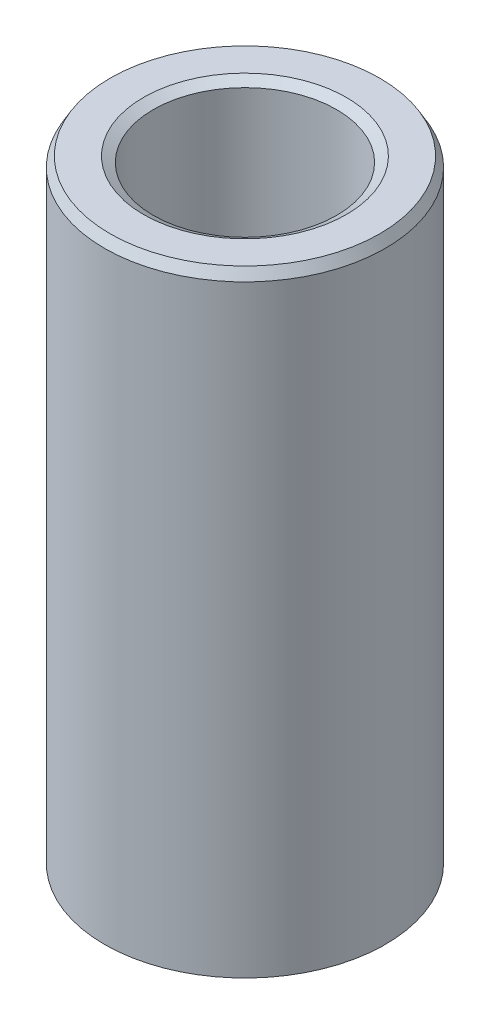
ISO-10303-21;
HEADER;
FILE_DESCRIPTION(('STEP AP214'),'2;1');
FILE_NAME('part.step','',(''),(''),'','','');
FILE_SCHEMA(('AUTOMOTIVE_DESIGN { 1 0 10303 214 1 1 1 1 }'));
ENDSEC;
DATA;
#1=APPLICATION_CONTEXT('core data for automotive mechanical design processes');
#2=APPLICATION_PROTOCOL_DEFINITION('international standard','automotive_design',2000,#1);
#3=PRODUCT_CONTEXT('',#1,'mechanical');
#4=PRODUCT('Part','Part','',(#3));
#5=PRODUCT_RELATED_PRODUCT_CATEGORY('part','',(#4));
#6=PRODUCT_DEFINITION_FORMATION('','',#4);
#7=PRODUCT_DEFINITION_CONTEXT('part definition',#1,'design');
#8=PRODUCT_DEFINITION('design','',#6,#7);
#9=PRODUCT_DEFINITION_SHAPE('','',#8);
#10=(LENGTH_UNIT() NAMED_UNIT(*) SI_UNIT(.MILLI.,.METRE.));
#11=(NAMED_UNIT(*) PLANE_ANGLE_UNIT() SI_UNIT($,.RADIAN.));
#12=(NAMED_UNIT(*) SI_UNIT($,.STERADIAN.) SOLID_ANGLE_UNIT());
#13=UNCERTAINTY_MEASURE_WITH_UNIT(LENGTH_MEASURE(1.E-05),#10,'distance_accuracy_value','');
#14=(GEOMETRIC_REPRESENTATION_CONTEXT(3) GLOBAL_UNCERTAINTY_ASSIGNED_CONTEXT((#13)) GLOBAL_UNIT_ASSIGNED_CONTEXT((#10,
#11,#12)) REPRESENTATION_CONTEXT('',''));
#15=CARTESIAN_POINT('',(0.,0.,0.));
#16=DIRECTION('',(0.,0.,1.));
#17=DIRECTION('',(1.,0.,0.));
#18=AXIS2_PLACEMENT_3D('',#15,#16,#17);
#19=CARTESIAN_POINT('',(0.,121.049952871459,0.));
#20=DIRECTION('',(0.,-1.,0.));
#21=DIRECTION('',(0.,0.,-1.));
#22=AXIS2_PLACEMENT_3D('',#19,#20,#21);
#23=CYLINDRICAL_SURFACE('',#22,27.5);
#24=CARTESIAN_POINT('',(0.,1.10536951392151,0.));
#25=DIRECTION('',(0.,1.,0.));
#26=DIRECTION('',(0.,0.,1.));
#27=AXIS2_PLACEMENT_3D('',#24,#25,#26);
#28=CIRCLE('',#27,27.5);
#29=CARTESIAN_POINT('',(0.,1.10536951392151,27.5));
#30=VERTEX_POINT('',#29);
#31=EDGE_CURVE('E10',#30,#30,#28,.T.);
#32=ORIENTED_EDGE('',*,*,#31,.T.);
#33=EDGE_LOOP('',(#32));
#34=FACE_BOUND('',#33,.T.);
#35=CARTESIAN_POINT('',(0.,119.13539671221,0.));
#36=DIRECTION('',(0.,1.,0.));
#37=DIRECTION('',(0.,0.,1.));
#38=AXIS2_PLACEMENT_3D('',#35,#36,#37);
#39=CIRCLE('',#38,27.5);
#40=CARTESIAN_POINT('',(0.,119.13539671221,27.5));
#41=VERTEX_POINT('',#40);
#42=EDGE_CURVE('E50',#41,#41,#39,.F.);
#43=ORIENTED_EDGE('',*,*,#42,.T.);
#44=EDGE_LOOP('',(#43));
#45=FACE_BOUND('',#44,.T.);
#46=ADVANCED_FACE('F39',(#34,#45),#23,.T.);
#47=CARTESIAN_POINT('',(0.,121.049952871459,0.));
#48=DIRECTION('',(0.,1.,0.));
#49=DIRECTION('',(0.,0.,1.));
#50=AXIS2_PLACEMENT_3D('',#47,#48,#49);
#51=PLANE('',#50);
#52=CARTESIAN_POINT('',(0.,121.049952871459,0.));
#53=DIRECTION('',(0.,1.,0.));
#54=DIRECTION('',(0.,0.,1.));
#55=AXIS2_PLACEMENT_3D('',#52,#53,#54);
#56=CIRCLE('',#55,19.8651325305748);
#57=CARTESIAN_POINT('',(0.,121.049952871459,19.8651325305748));
#58=VERTEX_POINT('',#57);
#59=EDGE_CURVE('E58',#58,#58,#56,.F.);
#60=ORIENTED_EDGE('',*,*,#59,.T.);
#61=EDGE_LOOP('',(#60));
#62=FACE_BOUND('',#61,.T.);
#63=CARTESIAN_POINT('',(0.,121.049952871459,0.));
#64=DIRECTION('',(0.,1.,0.));
#65=DIRECTION('',(0.,0.,1.));
#66=AXIS2_PLACEMENT_3D('',#63,#64,#65);
#67=CIRCLE('',#66,26.3946304860785);
#68=CARTESIAN_POINT('',(0.,121.049952871459,26.3946304860785));
#69=VERTEX_POINT('',#68);
#70=EDGE_CURVE('E61',#69,#69,#67,.T.);
#71=ORIENTED_EDGE('',*,*,#70,.T.);
#72=EDGE_LOOP('',(#71));
#73=FACE_BOUND('',#72,.T.);
#74=ADVANCED_FACE('F88',(#62,#73),#51,.T.);
#75=CARTESIAN_POINT('',(0.,0.,0.));
#76=DIRECTION('',(0.,1.,0.));
#77=DIRECTION('',(0.,0.,1.));
#78=AXIS2_PLACEMENT_3D('',#75,#76,#77);
#79=PLANE('',#78);
#80=CARTESIAN_POINT('',(0.,0.,0.));
#81=DIRECTION('',(0.,1.,0.));
#82=DIRECTION('',(0.,0.,1.));
#83=AXIS2_PLACEMENT_3D('',#80,#81,#82);
#84=CIRCLE('',#83,19.0559458852465);
#85=CARTESIAN_POINT('',(0.,0.,-19.0559458852465));
#86=VERTEX_POINT('',#85);
#87=EDGE_CURVE('E51',#86,#86,#84,.T.);
#88=ORIENTED_EDGE('',*,*,#87,.T.);
#89=EDGE_LOOP('',(#88));
#90=FACE_BOUND('',#89,.T.);
#91=CARTESIAN_POINT('',(0.,0.,0.));
#92=DIRECTION('',(0.,1.,0.));
#93=DIRECTION('',(0.,0.,1.));
#94=AXIS2_PLACEMENT_3D('',#91,#92,#93);
#95=CIRCLE('',#94,25.5854438407502);
#96=CARTESIAN_POINT('',(0.,0.,25.5854438407502));
#97=VERTEX_POINT('',#96);
#98=EDGE_CURVE('E54',#97,#97,#95,.F.);
#99=ORIENTED_EDGE('',*,*,#98,.T.);
#100=EDGE_LOOP('',(#99));
#101=FACE_BOUND('',#100,.T.);
#102=ADVANCED_FACE('F83',(#90,#101),#79,.F.);
#103=CARTESIAN_POINT('',(0.,121.049952871459,0.));
#104=DIRECTION('',(0.,-1.,0.));
#105=DIRECTION('',(0.,0.,-1.));
#106=AXIS2_PLACEMENT_3D('',#103,#104,#105);
#107=CYLINDRICAL_SURFACE('',#106,17.950576371325);
#108=CARTESIAN_POINT('',(0.,119.944583357538,0.));
#109=DIRECTION('',(0.,1.,0.));
#110=DIRECTION('',(0.,0.,1.));
#111=AXIS2_PLACEMENT_3D('',#108,#109,#110);
#112=CIRCLE('',#111,17.950576371325);
#113=CARTESIAN_POINT('',(0.,119.944583357538,17.950576371325));
#114=VERTEX_POINT('',#113);
#115=EDGE_CURVE('E67',#114,#114,#112,.T.);
#116=ORIENTED_EDGE('',*,*,#115,.T.);
#117=EDGE_LOOP('',(#116));
#118=FACE_BOUND('',#117,.T.);
#119=CARTESIAN_POINT('',(0.,1.91455615924981,0.));
#120=DIRECTION('',(0.,1.,0.));
#121=DIRECTION('',(0.,0.,1.));
#122=AXIS2_PLACEMENT_3D('',#119,#120,#121);
#123=CIRCLE('',#122,17.950576371325);
#124=CARTESIAN_POINT('',(0.,1.91455615924981,-17.950576371325));
#125=VERTEX_POINT('',#124);
#126=EDGE_CURVE('E69',#125,#125,#123,.F.);
#127=ORIENTED_EDGE('',*,*,#126,.T.);
#128=EDGE_LOOP('',(#127));
#129=FACE_BOUND('',#128,.T.);
#130=ADVANCED_FACE('F71',(#118,#129),#107,.F.);
#131=CARTESIAN_POINT('',(0.,119.944583357538,0.));
#132=DIRECTION('',(0.,1.,0.));
#133=DIRECTION('',(0.,0.,1.));
#134=AXIS2_PLACEMENT_3D('',#131,#132,#133);
#135=CONICAL_SURFACE('',#134,17.950576371325,1.0471975511966);
#136=ORIENTED_EDGE('',*,*,#59,.F.);
#137=EDGE_LOOP('',(#136));
#138=FACE_BOUND('',#137,.T.);
#139=ORIENTED_EDGE('',*,*,#115,.F.);
#140=EDGE_LOOP('',(#139));
#141=FACE_BOUND('',#140,.T.);
#142=ADVANCED_FACE('F77',(#138,#141),#135,.F.);
#143=CARTESIAN_POINT('',(0.,0.,0.));
#144=DIRECTION('',(0.,-1.,0.));
#145=DIRECTION('',(0.,0.,-1.));
#146=AXIS2_PLACEMENT_3D('',#143,#144,#145);
#147=CONICAL_SURFACE('',#146,19.0559458852465,0.523598775598295);
#148=CARTESIAN_POINT('',(0.,1.91455615924981,-17.950576371325));
#149=CARTESIAN_POINT('',(0.,1.89461286592429,-17.962090637095));
#150=CARTESIAN_POINT('',(0.,1.87466957259877,-17.973604902865));
#151=CARTESIAN_POINT('',(0.,1.83478298594773,-17.996633434405));
#152=CARTESIAN_POINT('',(0.,1.81483969262221,-18.008147700175));
#153=CARTESIAN_POINT('',(0.,1.77495310597117,-18.0311762317151));
#154=CARTESIAN_POINT('',(0.,1.75500981264566,-18.0426904974851));
#155=CARTESIAN_POINT('',(0.,1.71512322599462,-18.0657190290251));
#156=CARTESIAN_POINT('',(0.,1.6951799326691,-18.0772332947951));
#157=CARTESIAN_POINT('',(0.,1.65529334601806,-18.1002618263352));
#158=CARTESIAN_POINT('',(0.,1.63535005269254,-18.1117760921052));
#159=CARTESIAN_POINT('',(0.,1.5954634660415,-18.1348046236452));
#160=CARTESIAN_POINT('',(0.,1.57552017271599,-18.1463188894152));
#161=CARTESIAN_POINT('',(0.,1.53563358606495,-18.1693474209553));
#162=CARTESIAN_POINT('',(0.,1.51569029273943,-18.1808616867253));
#163=CARTESIAN_POINT('',(0.,1.47580370608839,-18.2038902182653));
#164=CARTESIAN_POINT('',(0.,1.45586041276287,-18.2154044840353));
#165=CARTESIAN_POINT('',(0.,1.41597382611184,-18.2384330155754));
#166=CARTESIAN_POINT('',(0.,1.39603053278632,-18.2499472813454));
#167=CARTESIAN_POINT('',(0.,1.35614394613528,-18.2729758128854));
#168=CARTESIAN_POINT('',(0.,1.33620065280976,-18.2844900786554));
#169=CARTESIAN_POINT('',(0.,1.29631406615872,-18.3075186101955));
#170=CARTESIAN_POINT('',(0.,1.2763707728332,-18.3190328759655));
#171=CARTESIAN_POINT('',(0.,1.23648418618217,-18.3420614075055));
#172=CARTESIAN_POINT('',(0.,1.21654089285665,-18.3535756732755));
#173=CARTESIAN_POINT('',(0.,1.17665430620561,-18.3766042048156));
#174=CARTESIAN_POINT('',(0.,1.15671101288009,-18.3881184705856));
#175=CARTESIAN_POINT('',(0.,1.11682442622905,-18.4111470021256));
#176=CARTESIAN_POINT('',(0.,1.09688113290353,-18.4226612678956));
#177=CARTESIAN_POINT('',(0.,1.0569945462525,-18.4456897994357));
#178=CARTESIAN_POINT('',(0.,1.03705125292698,-18.4572040652057));
#179=CARTESIAN_POINT('',(0.,0.99716466627594,-18.4802325967457));
#180=CARTESIAN_POINT('',(0.,0.977221372950421,-18.4917468625157));
#181=CARTESIAN_POINT('',(0.,0.937334786299384,-18.5147753940557));
#182=CARTESIAN_POINT('',(0.,0.917391492973865,-18.5262896598258));
#183=CARTESIAN_POINT('',(0.,0.877504906322828,-18.5493181913658));
#184=CARTESIAN_POINT('',(0.,0.857561612997308,-18.5608324571358));
#185=CARTESIAN_POINT('',(0.,0.817675026346271,-18.5838609886758));
#186=CARTESIAN_POINT('',(0.,0.797731733020752,-18.5953752544459));
#187=CARTESIAN_POINT('',(0.,0.757845146369715,-18.6184037859859));
#188=CARTESIAN_POINT('',(0.,0.737901853044196,-18.6299180517559));
#189=CARTESIAN_POINT('',(0.,0.698015266393158,-18.6529465832959));
#190=CARTESIAN_POINT('',(0.,0.678071973067639,-18.664460849066));
#191=CARTESIAN_POINT('',(0.,0.638185386416602,-18.687489380606));
#192=CARTESIAN_POINT('',(0.,0.618242093091083,-18.699003646376));
#193=CARTESIAN_POINT('',(0.,0.578355506440046,-18.722032177916));
#194=CARTESIAN_POINT('',(0.,0.558412213114527,-18.733546443686));
#195=CARTESIAN_POINT('',(0.,0.518525626463489,-18.7565749752261));
#196=CARTESIAN_POINT('',(0.,0.49858233313797,-18.7680892409961));
#197=CARTESIAN_POINT('',(0.,0.458695746486932,-18.7911177725361));
#198=CARTESIAN_POINT('',(0.,0.438752453161414,-18.8026320383061));
#199=CARTESIAN_POINT('',(0.,0.398865866510376,-18.8256605698462));
#200=CARTESIAN_POINT('',(0.,0.378922573184857,-18.8371748356162));
#201=CARTESIAN_POINT('',(0.,0.33903598653382,-18.8602033671562));
#202=CARTESIAN_POINT('',(0.,0.319092693208301,-18.8717176329262));
#203=CARTESIAN_POINT('',(0.,0.279206106557263,-18.8947461644663));
#204=CARTESIAN_POINT('',(0.,0.259262813231745,-18.9062604302363));
#205=CARTESIAN_POINT('',(0.,0.219376226580707,-18.9292889617763));
#206=CARTESIAN_POINT('',(0.,0.199432933255188,-18.9408032275463));
#207=CARTESIAN_POINT('',(0.,0.15954634660415,-18.9638317590864));
#208=CARTESIAN_POINT('',(0.,0.139603053278631,-18.9753460248564));
#209=CARTESIAN_POINT('',(0.,0.0997164666275938,-18.9983745563964));
#210=CARTESIAN_POINT('',(0.,0.0797731733020753,-19.0098888221664));
#211=CARTESIAN_POINT('',(0.,0.0398865866510381,-19.0329173537065));
#212=CARTESIAN_POINT('',(0.,0.0199432933255195,-19.0444316194765));
#213=CARTESIAN_POINT('',(0.,0.,-19.0559458852465));
#214=B_SPLINE_CURVE_WITH_KNOTS('',3,(#148,#149,#150,#151,#152,#153,#154,#155,#156,#157,#158,
#159,#160,#161,#162,#163,#164,#165,#166,#167,#168,#169,#170,#171,#172,#173,#174,#175,#176,#177,
#178,#179,#180,#181,#182,#183,#184,#185,#186,#187,#188,#189,#190,#191,#192,#193,#194,#195,#196,
#197,#198,#199,#200,#201,#202,#203,#204,#205,#206,#207,#208,#209,#210,#211,#212,#213),
.UNSPECIFIED.,.F.,.F.,(4,2,2,2,2,2,2,2,2,2,2,2,2,2,2,2,2,2,2,2,2,2,2,2,2,2,2,2,2,2,2,2,4),(0.,
0.069085594620095,0.138171189240192,0.207256783860287,0.276342378480382,0.345427973100478,
0.414513567720573,0.483599162340668,0.552684756960765,0.62177035158086,0.690855946200955,
0.759941540821052,0.829027135441147,0.898112730061242,0.967198324681338,1.03628391930143,
1.10536951392153,1.17445510854163,1.24354070316172,1.31262629778182,1.38171189240191,
1.45079748702201,1.5198830816421,1.5889686762622,1.65805427088229,1.72713986550239,
1.79622546012248,1.86531105474258,1.93439664936268,2.00348224398277,2.07256783860287,
2.14165343322296,2.21073902784306),.UNSPECIFIED.);
#215=EDGE_CURVE('BSEAM73',#125,#86,#214,.T.);
#216=ORIENTED_EDGE('',*,*,#126,.F.);
#217=ORIENTED_EDGE('',*,*,#87,.F.);
#218=ORIENTED_EDGE('',*,*,#215,.T.);
#219=ORIENTED_EDGE('',*,*,#215,.F.);
#220=EDGE_LOOP('',(#216,#218,#217,#219));
#221=FACE_BOUND('',#220,.T.);
#222=ADVANCED_FACE('F73',(#221),#147,.F.);
#223=CARTESIAN_POINT('',(0.,1.10536951392151,0.));
#224=DIRECTION('',(0.,1.,0.));
#225=DIRECTION('',(0.,0.,1.));
#226=AXIS2_PLACEMENT_3D('',#223,#224,#225);
#227=CONICAL_SURFACE('',#226,27.5,1.0471975511966);
#228=ORIENTED_EDGE('',*,*,#98,.F.);
#229=EDGE_LOOP('',(#228));
#230=FACE_BOUND('',#229,.T.);
#231=ORIENTED_EDGE('',*,*,#31,.F.);
#232=EDGE_LOOP('',(#231));
#233=FACE_BOUND('',#232,.T.);
#234=ADVANCED_FACE('F76',(#230,#233),#227,.T.);
#235=CARTESIAN_POINT('',(0.,121.049952871459,0.));
#236=DIRECTION('',(0.,-1.,0.));
#237=DIRECTION('',(0.,0.,-1.));
#238=AXIS2_PLACEMENT_3D('',#235,#236,#237);
#239=CONICAL_SURFACE('',#238,26.3946304860785,0.523598775598288);
#240=ORIENTED_EDGE('',*,*,#42,.F.);
#241=EDGE_LOOP('',(#240));
#242=FACE_BOUND('',#241,.T.);
#243=ORIENTED_EDGE('',*,*,#70,.F.);
#244=EDGE_LOOP('',(#243));
#245=FACE_BOUND('',#244,.T.);
#246=ADVANCED_FACE('F45',(#242,#245),#239,.T.);
#247=CLOSED_SHELL('',(#46,#74,#102,#130,#142,#222,#234,#246));
#248=MANIFOLD_SOLID_BREP('B2',#247);
#249=ADVANCED_BREP_SHAPE_REPRESENTATION('',(#18,#248),#14);
#250=SHAPE_DEFINITION_REPRESENTATION(#9,#249);
ENDSEC;
END-ISO-10303-21;
